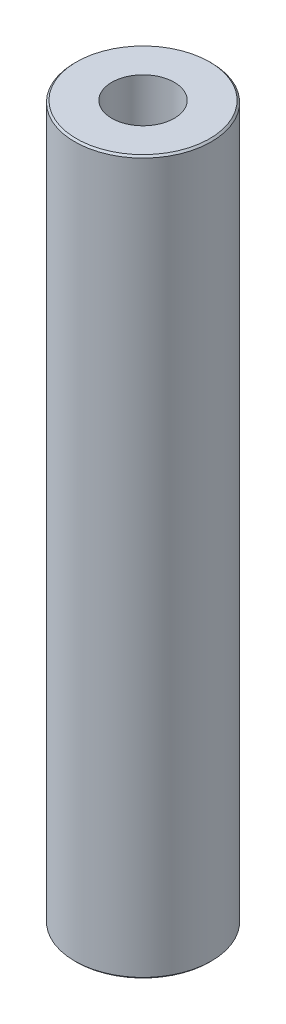
ISO-10303-21;
HEADER;
FILE_DESCRIPTION(('STEP AP214'),'2;1');
FILE_NAME('part.step','',(''),(''),'','','');
FILE_SCHEMA(('AUTOMOTIVE_DESIGN { 1 0 10303 214 1 1 1 1 }'));
ENDSEC;
DATA;
#1=APPLICATION_CONTEXT('core data for automotive mechanical design processes');
#2=APPLICATION_PROTOCOL_DEFINITION('international standard','automotive_design',2000,#1);
#3=PRODUCT_CONTEXT('',#1,'mechanical');
#4=PRODUCT('Part','Part','',(#3));
#5=PRODUCT_RELATED_PRODUCT_CATEGORY('part','',(#4));
#6=PRODUCT_DEFINITION_FORMATION('','',#4);
#7=PRODUCT_DEFINITION_CONTEXT('part definition',#1,'design');
#8=PRODUCT_DEFINITION('design','',#6,#7);
#9=PRODUCT_DEFINITION_SHAPE('','',#8);
#10=(LENGTH_UNIT() NAMED_UNIT(*) SI_UNIT(.MILLI.,.METRE.));
#11=(NAMED_UNIT(*) PLANE_ANGLE_UNIT() SI_UNIT($,.RADIAN.));
#12=(NAMED_UNIT(*) SI_UNIT($,.STERADIAN.) SOLID_ANGLE_UNIT());
#13=UNCERTAINTY_MEASURE_WITH_UNIT(LENGTH_MEASURE(1.E-05),#10,'distance_accuracy_value','');
#14=(GEOMETRIC_REPRESENTATION_CONTEXT(3) GLOBAL_UNCERTAINTY_ASSIGNED_CONTEXT((#13)) GLOBAL_UNIT_ASSIGNED_CONTEXT((#10,
#11,#12)) REPRESENTATION_CONTEXT('',''));
#15=CARTESIAN_POINT('',(0.,0.,0.));
#16=DIRECTION('',(0.,0.,1.));
#17=DIRECTION('',(1.,0.,0.));
#18=AXIS2_PLACEMENT_3D('',#15,#16,#17);
#19=CARTESIAN_POINT('',(0.,600.,0.));
#20=DIRECTION('',(0.,-1.,0.));
#21=DIRECTION('',(0.,0.,-1.));
#22=AXIS2_PLACEMENT_3D('',#19,#20,#21);
#23=CYLINDRICAL_SURFACE('',#22,57.5);
#24=CARTESIAN_POINT('',(0.,598.507299648926,0.));
#25=DIRECTION('',(0.,1.,0.));
#26=DIRECTION('',(0.,0.,1.));
#27=AXIS2_PLACEMENT_3D('',#24,#25,#26);
#28=CIRCLE('',#27,57.5);
#29=CARTESIAN_POINT('',(0.,598.507299648926,-57.5000000000001));
#30=VERTEX_POINT('',#29);
#31=EDGE_CURVE('E50',#30,#30,#28,.F.);
#32=ORIENTED_EDGE('',*,*,#31,.T.);
#33=EDGE_LOOP('',(#32));
#34=FACE_BOUND('',#33,.T.);
#35=CARTESIAN_POINT('',(0.,1.49270035107352,0.));
#36=DIRECTION('',(0.,1.,0.));
#37=DIRECTION('',(0.,0.,1.));
#38=AXIS2_PLACEMENT_3D('',#35,#36,#37);
#39=CIRCLE('',#38,57.5);
#40=CARTESIAN_POINT('',(0.,1.49270035107352,57.5));
#41=VERTEX_POINT('',#40);
#42=EDGE_CURVE('E51',#41,#41,#39,.T.);
#43=ORIENTED_EDGE('',*,*,#42,.T.);
#44=EDGE_LOOP('',(#43));
#45=FACE_BOUND('',#44,.T.);
#46=ADVANCED_FACE('F39',(#34,#45),#23,.T.);
#47=CARTESIAN_POINT('',(0.,600.,0.));
#48=DIRECTION('',(0.,1.,0.));
#49=DIRECTION('',(0.,0.,1.));
#50=AXIS2_PLACEMENT_3D('',#47,#48,#49);
#51=PLANE('',#50);
#52=CARTESIAN_POINT('',(0.,600.,0.));
#53=DIRECTION('',(0.,1.,0.));
#54=DIRECTION('',(0.,0.,1.));
#55=AXIS2_PLACEMENT_3D('',#52,#53,#54);
#56=CIRCLE('',#55,56.0072996489263);
#57=CARTESIAN_POINT('',(0.,600.,-56.0072996489264));
#58=VERTEX_POINT('',#57);
#59=EDGE_CURVE('E54',#58,#58,#56,.T.);
#60=ORIENTED_EDGE('',*,*,#59,.T.);
#61=EDGE_LOOP('',(#60));
#62=FACE_BOUND('',#61,.T.);
#63=CARTESIAN_POINT('',(0.,600.,0.));
#64=DIRECTION('',(0.,1.,0.));
#65=DIRECTION('',(0.,0.,1.));
#66=AXIS2_PLACEMENT_3D('',#63,#64,#65);
#67=CIRCLE('',#66,26.3038184915616);
#68=CARTESIAN_POINT('',(0.,600.,26.3038184915616));
#69=VERTEX_POINT('',#68);
#70=EDGE_CURVE('E58',#69,#69,#67,.T.);
#71=ORIENTED_EDGE('',*,*,#70,.F.);
#72=EDGE_LOOP('',(#71));
#73=FACE_BOUND('',#72,.T.);
#74=ADVANCED_FACE('F69',(#62,#73),#51,.T.);
#75=CARTESIAN_POINT('',(0.,0.,0.));
#76=DIRECTION('',(0.,1.,0.));
#77=DIRECTION('',(0.,0.,1.));
#78=AXIS2_PLACEMENT_3D('',#75,#76,#77);
#79=PLANE('',#78);
#80=CARTESIAN_POINT('',(0.,0.,0.));
#81=DIRECTION('',(0.,1.,0.));
#82=DIRECTION('',(0.,0.,1.));
#83=AXIS2_PLACEMENT_3D('',#80,#81,#82);
#84=CIRCLE('',#83,56.0072996489265);
#85=CARTESIAN_POINT('',(0.,0.,56.0072996489265));
#86=VERTEX_POINT('',#85);
#87=EDGE_CURVE('E10',#86,#86,#84,.F.);
#88=ORIENTED_EDGE('',*,*,#87,.T.);
#89=EDGE_LOOP('',(#88));
#90=FACE_BOUND('',#89,.T.);
#91=CARTESIAN_POINT('',(0.,0.,0.));
#92=DIRECTION('',(0.,1.,0.));
#93=DIRECTION('',(0.,0.,1.));
#94=AXIS2_PLACEMENT_3D('',#91,#92,#93);
#95=CIRCLE('',#94,26.3038184915616);
#96=CARTESIAN_POINT('',(0.,0.,26.3038184915616));
#97=VERTEX_POINT('',#96);
#98=EDGE_CURVE('E63',#97,#97,#95,.T.);
#99=ORIENTED_EDGE('',*,*,#98,.T.);
#100=EDGE_LOOP('',(#99));
#101=FACE_BOUND('',#100,.T.);
#102=ADVANCED_FACE('F75',(#90,#101),#79,.F.);
#103=CARTESIAN_POINT('',(0.,600.,0.));
#104=DIRECTION('',(0.,-1.,0.));
#105=DIRECTION('',(0.,0.,-1.));
#106=AXIS2_PLACEMENT_3D('',#103,#104,#105);
#107=CYLINDRICAL_SURFACE('',#106,26.3038184915616);
#108=ORIENTED_EDGE('',*,*,#70,.T.);
#109=EDGE_LOOP('',(#108));
#110=FACE_BOUND('',#109,.T.);
#111=ORIENTED_EDGE('',*,*,#98,.F.);
#112=EDGE_LOOP('',(#111));
#113=FACE_BOUND('',#112,.T.);
#114=ADVANCED_FACE('F70',(#110,#113),#107,.F.);
#115=CARTESIAN_POINT('',(0.,600.,0.));
#116=DIRECTION('',(0.,-1.,0.));
#117=DIRECTION('',(0.,0.,-1.));
#118=AXIS2_PLACEMENT_3D('',#115,#116,#117);
#119=CONICAL_SURFACE('',#118,56.0072996489263,0.785398163397395);
#120=CARTESIAN_POINT('',(0.,598.507299648926,-57.5000000000001));
#121=CARTESIAN_POINT('',(0.,598.522848610916,-57.4844510380097));
#122=CARTESIAN_POINT('',(0.,598.538397572907,-57.4689020760193));
#123=CARTESIAN_POINT('',(0.,598.569495496887,-57.4378041520387));
#124=CARTESIAN_POINT('',(0.,598.585044458878,-57.4222551900483));
#125=CARTESIAN_POINT('',(0.,598.616142382859,-57.3911572660676));
#126=CARTESIAN_POINT('',(0.,598.631691344849,-57.3756083040772));
#127=CARTESIAN_POINT('',(0.,598.66278926883,-57.3445103800965));
#128=CARTESIAN_POINT('',(0.,598.67833823082,-57.3289614181062));
#129=CARTESIAN_POINT('',(0.,598.709436154801,-57.2978634941255));
#130=CARTESIAN_POINT('',(0.,598.724985116791,-57.2823145321351));
#131=CARTESIAN_POINT('',(0.,598.756083040772,-57.2512166081544));
#132=CARTESIAN_POINT('',(0.,598.771632002762,-57.2356676461641));
#133=CARTESIAN_POINT('',(0.,598.802729926743,-57.2045697221834));
#134=CARTESIAN_POINT('',(0.,598.818278888733,-57.189020760193));
#135=CARTESIAN_POINT('',(0.,598.849376812714,-57.1579228362123));
#136=CARTESIAN_POINT('',(0.,598.864925774704,-57.142373874222));
#137=CARTESIAN_POINT('',(0.,598.896023698685,-57.1112759502413));
#138=CARTESIAN_POINT('',(0.,598.911572660675,-57.0957269882509));
#139=CARTESIAN_POINT('',(0.,598.942670584656,-57.0646290642702));
#140=CARTESIAN_POINT('',(0.,598.958219546646,-57.0490801022799));
#141=CARTESIAN_POINT('',(0.,598.989317470627,-57.0179821782992));
#142=CARTESIAN_POINT('',(0.,599.004866432617,-57.0024332163088));
#143=CARTESIAN_POINT('',(0.,599.035964356598,-56.9713352923281));
#144=CARTESIAN_POINT('',(0.,599.051513318588,-56.9557863303378));
#145=CARTESIAN_POINT('',(0.,599.082611242569,-56.9246884063571));
#146=CARTESIAN_POINT('',(0.,599.09816020456,-56.9091394443667));
#147=CARTESIAN_POINT('',(0.,599.12925812854,-56.878041520386));
#148=CARTESIAN_POINT('',(0.,599.144807090531,-56.8624925583957));
#149=CARTESIAN_POINT('',(0.,599.175905014511,-56.831394634415));
#150=CARTESIAN_POINT('',(0.,599.191453976502,-56.8158456724246));
#151=CARTESIAN_POINT('',(0.,599.222551900482,-56.7847477484439));
#152=CARTESIAN_POINT('',(0.,599.238100862473,-56.7691987864536));
#153=CARTESIAN_POINT('',(0.,599.269198786453,-56.7381008624729));
#154=CARTESIAN_POINT('',(0.,599.284747748444,-56.7225519004825));
#155=CARTESIAN_POINT('',(0.,599.315845672424,-56.6914539765018));
#156=CARTESIAN_POINT('',(0.,599.331394634415,-56.6759050145115));
#157=CARTESIAN_POINT('',(0.,599.362492558396,-56.6448070905308));
#158=CARTESIAN_POINT('',(0.,599.378041520386,-56.6292581285404));
#159=CARTESIAN_POINT('',(0.,599.409139444367,-56.5981602045597));
#160=CARTESIAN_POINT('',(0.,599.424688406357,-56.5826112425694));
#161=CARTESIAN_POINT('',(0.,599.455786330338,-56.5515133185887));
#162=CARTESIAN_POINT('',(0.,599.471335292328,-56.5359643565983));
#163=CARTESIAN_POINT('',(0.,599.502433216309,-56.5048664326176));
#164=CARTESIAN_POINT('',(0.,599.517982178299,-56.4893174706273));
#165=CARTESIAN_POINT('',(0.,599.54908010228,-56.4582195466466));
#166=CARTESIAN_POINT('',(0.,599.56462906427,-56.4426705846562));
#167=CARTESIAN_POINT('',(0.,599.595726988251,-56.4115726606755));
#168=CARTESIAN_POINT('',(0.,599.611275950241,-56.3960236986851));
#169=CARTESIAN_POINT('',(0.,599.642373874222,-56.3649257747045));
#170=CARTESIAN_POINT('',(0.,599.657922836212,-56.3493768127141));
#171=CARTESIAN_POINT('',(0.,599.689020760193,-56.3182788887334));
#172=CARTESIAN_POINT('',(0.,599.704569722183,-56.302729926743));
#173=CARTESIAN_POINT('',(0.,599.735667646164,-56.2716320027623));
#174=CARTESIAN_POINT('',(0.,599.751216608154,-56.256083040772));
#175=CARTESIAN_POINT('',(0.,599.782314532135,-56.2249851167913));
#176=CARTESIAN_POINT('',(0.,599.797863494125,-56.2094361548009));
#177=CARTESIAN_POINT('',(0.,599.828961418106,-56.1783382308202));
#178=CARTESIAN_POINT('',(0.,599.844510380096,-56.1627892688299));
#179=CARTESIAN_POINT('',(0.,599.875608304077,-56.1316913448492));
#180=CARTESIAN_POINT('',(0.,599.891157266067,-56.1161423828588));
#181=CARTESIAN_POINT('',(0.,599.922255190048,-56.0850444588781));
#182=CARTESIAN_POINT('',(0.,599.937804152039,-56.0694954968878));
#183=CARTESIAN_POINT('',(0.,599.968902076019,-56.038397572907));
#184=CARTESIAN_POINT('',(0.,599.98445103801,-56.0228486109167));
#185=CARTESIAN_POINT('',(0.,600.,-56.0072996489264));
#186=B_SPLINE_CURVE_WITH_KNOTS('',3,(#120,#121,#122,#123,#124,#125,#126,#127,#128,#129,#130,
#131,#132,#133,#134,#135,#136,#137,#138,#139,#140,#141,#142,#143,#144,#145,#146,#147,#148,#149,
#150,#151,#152,#153,#154,#155,#156,#157,#158,#159,#160,#161,#162,#163,#164,#165,#166,#167,#168,
#169,#170,#171,#172,#173,#174,#175,#176,#177,#178,#179,#180,#181,#182,#183,#184,#185),
.UNSPECIFIED.,.F.,.F.,(4,2,2,2,2,2,2,2,2,2,2,2,2,2,2,2,2,2,2,2,2,2,2,2,2,2,2,2,2,2,2,2,4),(0.,
0.0659686587826971,0.131937317565478,0.197905976348175,0.26387463513095,0.329843293913647,
0.395811952696428,0.461780611479125,0.5277492702619,0.593717929044602,0.659686587827378,
0.725655246610075,0.79162390539285,0.857592564175552,0.923561222958328,0.989529881741025,
1.05549854052381,1.1214671993065,1.18743585808928,1.25340451687198,1.31937317565476,
1.38534183443745,1.45131049322023,1.51727915200293,1.58324781078571,1.6492164695684,
1.71518512835118,1.78115378713388,1.84712244591666,1.91309110469935,1.97905976348213,
2.04502842226483,2.11099708104761),.UNSPECIFIED.);
#187=EDGE_CURVE('BSEAM81',#30,#58,#186,.T.);
#188=ORIENTED_EDGE('',*,*,#31,.F.);
#189=ORIENTED_EDGE('',*,*,#59,.F.);
#190=ORIENTED_EDGE('',*,*,#187,.T.);
#191=ORIENTED_EDGE('',*,*,#187,.F.);
#192=EDGE_LOOP('',(#188,#190,#189,#191));
#193=FACE_BOUND('',#192,.T.);
#194=ADVANCED_FACE('F81',(#193),#119,.T.);
#195=CARTESIAN_POINT('',(0.,1.49270035107352,0.));
#196=DIRECTION('',(0.,1.,0.));
#197=DIRECTION('',(0.,0.,1.));
#198=AXIS2_PLACEMENT_3D('',#195,#196,#197);
#199=CONICAL_SURFACE('',#198,57.5,0.785398163397448);
#200=ORIENTED_EDGE('',*,*,#87,.F.);
#201=EDGE_LOOP('',(#200));
#202=FACE_BOUND('',#201,.T.);
#203=ORIENTED_EDGE('',*,*,#42,.F.);
#204=EDGE_LOOP('',(#203));
#205=FACE_BOUND('',#204,.T.);
#206=ADVANCED_FACE('F45',(#202,#205),#199,.T.);
#207=CLOSED_SHELL('',(#46,#74,#102,#114,#194,#206));
#208=MANIFOLD_SOLID_BREP('B2',#207);
#209=ADVANCED_BREP_SHAPE_REPRESENTATION('',(#18,#208),#14);
#210=SHAPE_DEFINITION_REPRESENTATION(#9,#209);
ENDSEC;
END-ISO-10303-21;
